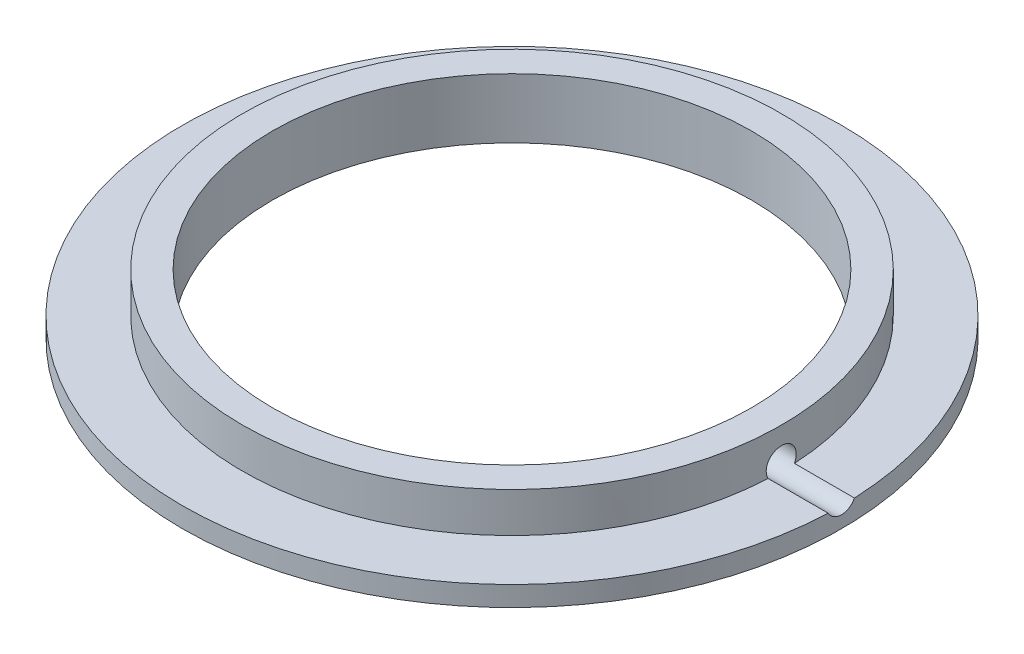
ISO-10303-21;
HEADER;
FILE_DESCRIPTION(('STEP AP214'),'2;1');
FILE_NAME('part.step','',(''),(''),'','','');
FILE_SCHEMA(('AUTOMOTIVE_DESIGN { 1 0 10303 214 1 1 1 1 }'));
ENDSEC;
DATA;
#1=APPLICATION_CONTEXT('core data for automotive mechanical design processes');
#2=APPLICATION_PROTOCOL_DEFINITION('international standard','automotive_design',2000,#1);
#3=PRODUCT_CONTEXT('',#1,'mechanical');
#4=PRODUCT('Part','Part','',(#3));
#5=PRODUCT_RELATED_PRODUCT_CATEGORY('part','',(#4));
#6=PRODUCT_DEFINITION_FORMATION('','',#4);
#7=PRODUCT_DEFINITION_CONTEXT('part definition',#1,'design');
#8=PRODUCT_DEFINITION('design','',#6,#7);
#9=PRODUCT_DEFINITION_SHAPE('','',#8);
#10=(LENGTH_UNIT() NAMED_UNIT(*) SI_UNIT(.MILLI.,.METRE.));
#11=(NAMED_UNIT(*) PLANE_ANGLE_UNIT() SI_UNIT($,.RADIAN.));
#12=(NAMED_UNIT(*) SI_UNIT($,.STERADIAN.) SOLID_ANGLE_UNIT());
#13=UNCERTAINTY_MEASURE_WITH_UNIT(LENGTH_MEASURE(1.E-05),#10,'distance_accuracy_value','');
#14=(GEOMETRIC_REPRESENTATION_CONTEXT(3) GLOBAL_UNCERTAINTY_ASSIGNED_CONTEXT((#13)) GLOBAL_UNIT_ASSIGNED_CONTEXT((#10,
#11,#12)) REPRESENTATION_CONTEXT('',''));
#15=CARTESIAN_POINT('',(0.,0.,0.));
#16=DIRECTION('',(0.,0.,1.));
#17=DIRECTION('',(1.,0.,0.));
#18=AXIS2_PLACEMENT_3D('',#15,#16,#17);
#19=CARTESIAN_POINT('',(0.,1.,0.));
#20=DIRECTION('',(0.,-1.,0.));
#21=DIRECTION('',(0.,0.,-1.));
#22=AXIS2_PLACEMENT_3D('',#19,#20,#21);
#23=CYLINDRICAL_SURFACE('',#22,16.5);
#24=CARTESIAN_POINT('',(0.,0.,0.));
#25=DIRECTION('',(0.,1.,0.));
#26=DIRECTION('',(0.,0.,1.));
#27=AXIS2_PLACEMENT_3D('',#24,#25,#26);
#28=CIRCLE('',#27,16.5);
#29=CARTESIAN_POINT('',(0.,0.,16.5));
#30=VERTEX_POINT('',#29);
#31=EDGE_CURVE('E46',#30,#30,#28,.T.);
#32=ORIENTED_EDGE('',*,*,#31,.T.);
#33=EDGE_LOOP('',(#32));
#34=FACE_BOUND('',#33,.T.);
#35=CARTESIAN_POINT('',(16.4868765992834,1.,0.657951365983839));
#36=CARTESIAN_POINT('',(16.4876833379462,0.962960108270043,0.637725419364401));
#37=CARTESIAN_POINT('',(16.4885807541448,0.927674301830206,0.614320157853908));
#38=CARTESIAN_POINT('',(16.4904484709403,0.861536434292758,0.561958452032811));
#39=CARTESIAN_POINT('',(16.4914187185096,0.830681194125467,0.533006023161448));
#40=CARTESIAN_POINT('',(16.4933255406306,0.77426102802423,0.47031155166238));
#41=CARTESIAN_POINT('',(16.4942620994731,0.748698544378894,0.436567309955041));
#42=CARTESIAN_POINT('',(16.4959948700238,0.703604763923448,0.365271263773181));
#43=CARTESIAN_POINT('',(16.4967911093437,0.684072279977721,0.327720210687867));
#44=CARTESIAN_POINT('',(16.4981537441256,0.651591820430562,0.249873173165701));
#45=CARTESIAN_POINT('',(16.4987201741902,0.638642853467569,0.209577603041595));
#46=CARTESIAN_POINT('',(16.4995595196029,0.619692769858873,0.127375286806824));
#47=CARTESIAN_POINT('',(16.4998323919312,0.613692671536965,0.0854683054809608));
#48=CARTESIAN_POINT('',(16.5000535863455,0.608817903203791,0.00128088901380076));
#49=CARTESIAN_POINT('',(16.5000022144909,0.609936513734719,-0.0409991563440351));
#50=CARTESIAN_POINT('',(16.499581447377,0.619251004206329,-0.12476616985426));
#51=CARTESIAN_POINT('',(16.4992120862815,0.627446123866405,-0.166253222714167));
#52=CARTESIAN_POINT('',(16.4981971716211,0.650673945532818,-0.247246796418182));
#53=CARTESIAN_POINT('',(16.4975517153555,0.665704238856917,-0.286754009508052));
#54=CARTESIAN_POINT('',(16.4960569300761,0.702182065236904,-0.362698493159102));
#55=CARTESIAN_POINT('',(16.4952075371901,0.723631609299232,-0.399134797082515));
#56=CARTESIAN_POINT('',(16.4933994233861,0.772362999446572,-0.467935447552244));
#57=CARTESIAN_POINT('',(16.4924405544464,0.799652786705083,-0.500294153503792));
#58=CARTESIAN_POINT('',(16.4905232657077,0.859261747579752,-0.559940559430578));
#59=CARTESIAN_POINT('',(16.4895648472062,0.891573720480946,-0.587235398846315));
#60=CARTESIAN_POINT('',(16.4883477564197,0.937798272830575,-0.620048222905477));
#61=CARTESIAN_POINT('',(16.4880410259913,0.949939009522424,-0.628142755962978));
#62=CARTESIAN_POINT('',(16.4874449823137,0.974650729375382,-0.643597201422278));
#63=CARTESIAN_POINT('',(16.4871556399936,0.98722093599651,-0.650958354321469));
#64=CARTESIAN_POINT('',(16.4868765992834,1.,-0.657951365983839));
#65=B_SPLINE_CURVE_WITH_KNOTS('',3,(#35,#36,#37,#38,#39,#40,#41,#42,#43,#44,#45,#46,#47,#48,#49,
#50,#51,#52,#53,#54,#55,#56,#57,#58,#59,#60,#61,#62,#63,#64),.UNSPECIFIED.,.F.,.F.,(4,2,2,2,2,2,
2,2,2,2,2,2,2,2,4),(0.,0.126461639768176,0.252832081007328,0.379260705279178,0.505664423450857,
0.632049101809983,0.758452298902637,0.884736199799209,1.01100653478992,1.1372324071632,
1.26349786472281,1.38993611303403,1.51619472100948,1.55996122521623,1.60365239550557),.UNSPECIFIED.);
#66=CARTESIAN_POINT('',(16.4868765992834,1.,0.657951365983839));
#67=VERTEX_POINT('',#66);
#68=CARTESIAN_POINT('',(16.4868765992834,1.,-0.657951365983839));
#69=VERTEX_POINT('',#68);
#70=EDGE_CURVE('E59',#67,#69,#65,.T.);
#71=ORIENTED_EDGE('',*,*,#70,.F.);
#72=CARTESIAN_POINT('',(0.,1.,0.));
#73=DIRECTION('',(0.,1.,0.));
#74=DIRECTION('',(0.,0.,1.));
#75=AXIS2_PLACEMENT_3D('',#72,#73,#74);
#76=CIRCLE('',#75,16.5);
#77=EDGE_CURVE('E11',#69,#67,#76,.T.);
#78=ORIENTED_EDGE('',*,*,#77,.F.);
#79=EDGE_LOOP('',(#71,#78));
#80=FACE_BOUND('',#79,.T.);
#81=ADVANCED_FACE('F33',(#34,#80),#23,.T.);
#82=CARTESIAN_POINT('',(0.,1.,0.));
#83=DIRECTION('',(0.,1.,0.));
#84=DIRECTION('',(0.,0.,1.));
#85=AXIS2_PLACEMENT_3D('',#82,#83,#84);
#86=PLANE('',#85);
#87=CARTESIAN_POINT('',(0.,1.,0.));
#88=DIRECTION('',(0.,1.,0.));
#89=DIRECTION('',(0.,0.,1.));
#90=AXIS2_PLACEMENT_3D('',#87,#88,#89);
#91=CIRCLE('',#90,13.5);
#92=CARTESIAN_POINT('',(13.4839571343134,1.,0.657951365983839));
#93=VERTEX_POINT('',#92);
#94=CARTESIAN_POINT('',(13.4839571343134,1.,-0.657951365983839));
#95=VERTEX_POINT('',#94);
#96=EDGE_CURVE('E73',#93,#95,#91,.F.);
#97=ORIENTED_EDGE('',*,*,#96,.T.);
#98=DIRECTION('',(-1.,0.,0.));
#99=VECTOR('',#98,1.);
#100=CARTESIAN_POINT('',(17.,1.,-0.657951365983839));
#101=LINE('',#100,#99);
#102=EDGE_CURVE('E54',#95,#69,#101,.F.);
#103=ORIENTED_EDGE('',*,*,#102,.T.);
#104=ORIENTED_EDGE('',*,*,#77,.T.);
#105=DIRECTION('',(-1.,0.,0.));
#106=VECTOR('',#105,1.);
#107=CARTESIAN_POINT('',(17.,1.,0.657951365983839));
#108=LINE('',#107,#106);
#109=EDGE_CURVE('E66',#67,#93,#108,.T.);
#110=ORIENTED_EDGE('',*,*,#109,.T.);
#111=EDGE_LOOP('',(#97,#103,#104,#110));
#112=FACE_BOUND('',#111,.T.);
#113=ADVANCED_FACE('F72',(#112),#86,.T.);
#114=CARTESIAN_POINT('',(0.,3.,0.));
#115=DIRECTION('',(0.,-1.,0.));
#116=DIRECTION('',(0.,0.,-1.));
#117=AXIS2_PLACEMENT_3D('',#114,#115,#116);
#118=CYLINDRICAL_SURFACE('',#117,13.5);
#119=CARTESIAN_POINT('',(0.,3.,0.));
#120=DIRECTION('',(0.,1.,0.));
#121=DIRECTION('',(0.,0.,1.));
#122=AXIS2_PLACEMENT_3D('',#119,#120,#121);
#123=CIRCLE('',#122,13.5);
#124=CARTESIAN_POINT('',(0.,3.,13.5));
#125=VERTEX_POINT('',#124);
#126=EDGE_CURVE('E77',#125,#125,#123,.T.);
#127=ORIENTED_EDGE('',*,*,#126,.F.);
#128=EDGE_LOOP('',(#127));
#129=FACE_BOUND('',#128,.T.);
#130=CARTESIAN_POINT('',(13.4839571343134,1.,-0.657951365983839));
#131=CARTESIAN_POINT('',(13.4829639899617,1.03695165013405,-0.678210459099172));
#132=CARTESIAN_POINT('',(13.4820891442535,1.07563542423775,-0.695289318259189));
#133=CARTESIAN_POINT('',(13.4806479930376,1.15528993468038,-0.722739601423298));
#134=CARTESIAN_POINT('',(13.4800814691034,1.19625902926828,-0.73311577483726));
#135=CARTESIAN_POINT('',(13.479327104592,1.2793833320724,-0.746846842489374));
#136=CARTESIAN_POINT('',(13.4791394532905,1.32153912247593,-0.750198227345299));
#137=CARTESIAN_POINT('',(13.4791626814607,1.40580588051924,-0.749783789688884));
#138=CARTESIAN_POINT('',(13.4793734763956,1.44791685577063,-0.746019476884902));
#139=CARTESIAN_POINT('',(13.4801698744889,1.53088362124593,-0.731485959105203));
#140=CARTESIAN_POINT('',(13.4807552626461,1.57174011740102,-0.720720772283952));
#141=CARTESIAN_POINT('',(13.4822345604551,1.65107217443385,-0.692495346791738));
#142=CARTESIAN_POINT('',(13.4831285203186,1.68954734661376,-0.675034018455289));
#143=CARTESIAN_POINT('',(13.4851250615877,1.76305163088999,-0.633896361394058));
#144=CARTESIAN_POINT('',(13.4862278068687,1.79807800298032,-0.610215144998022));
#145=CARTESIAN_POINT('',(13.4885172155161,1.86365923235761,-0.557316858666673));
#146=CARTESIAN_POINT('',(13.4897038742078,1.89421433844466,-0.528100096960212));
#147=CARTESIAN_POINT('',(13.4920292459961,1.95002859641628,-0.464914417661529));
#148=CARTESIAN_POINT('',(13.4931678959028,1.97528093255812,-0.43093947661524));
#149=CARTESIAN_POINT('',(13.4952673604024,2.01972400200207,-0.359226592542001));
#150=CARTESIAN_POINT('',(13.4962281716189,2.03891462022346,-0.321488578091611));
#151=CARTESIAN_POINT('',(13.497863379786,2.07068197044403,-0.243331141255163));
#152=CARTESIAN_POINT('',(13.4985378591261,2.08326060523141,-0.202912494073087));
#153=CARTESIAN_POINT('',(13.4995247203172,2.10145200937286,-0.12053295205401));
#154=CARTESIAN_POINT('',(13.4998371076048,2.10706488331144,-0.0785720803818349));
#155=CARTESIAN_POINT('',(13.5000643888956,2.11116100761349,0.0056393506149272));
#156=CARTESIAN_POINT('',(13.4999798281346,2.10965403755969,0.0478894330289493));
#157=CARTESIAN_POINT('',(13.4994239909716,2.09957616194939,0.131535796161776));
#158=CARTESIAN_POINT('',(13.4989527152801,2.0910052693697,0.172932078448914));
#159=CARTESIAN_POINT('',(13.4976766970463,2.06704884201685,0.253682938747273));
#160=CARTESIAN_POINT('',(13.4968720635106,2.05166553476055,0.293038179441279));
#161=CARTESIAN_POINT('',(13.4950197388363,2.01452281351665,0.368608955339374));
#162=CARTESIAN_POINT('',(13.4939720452514,1.99276333535533,0.404824458938458));
#163=CARTESIAN_POINT('',(13.4917498404175,1.94345444391993,0.473135856813811));
#164=CARTESIAN_POINT('',(13.4905751749997,1.91589795265358,0.505226637036262));
#165=CARTESIAN_POINT('',(13.4882322301666,1.8557906913474,0.564329811254234));
#166=CARTESIAN_POINT('',(13.487063950815,1.82323987154117,0.591342154639293));
#167=CARTESIAN_POINT('',(13.4848643449244,1.7540325401326,0.639545335582111));
#168=CARTESIAN_POINT('',(13.4838331423898,1.71737236557801,0.660730920323212));
#169=CARTESIAN_POINT('',(13.4820255231305,1.6410111910472,0.696643911712528));
#170=CARTESIAN_POINT('',(13.4812490906074,1.60131037981035,0.71137171882894));
#171=CARTESIAN_POINT('',(13.4800394100473,1.52003438347111,0.733938760799265));
#172=CARTESIAN_POINT('',(13.4796058228707,1.47846109375472,0.74178480387323));
#173=CARTESIAN_POINT('',(13.4791296561988,1.39457037284459,0.750388567475981));
#174=CARTESIAN_POINT('',(13.4790872062299,1.35225269979348,0.751143939907066));
#175=CARTESIAN_POINT('',(13.4793980138819,1.26812119616291,0.74554394958996));
#176=CARTESIAN_POINT('',(13.4797510288503,1.22630707251576,0.739192947230847));
#177=CARTESIAN_POINT('',(13.4808128901258,1.14439816264248,0.719571318692191));
#178=CARTESIAN_POINT('',(13.4815211638896,1.10430072226411,0.706311825070558));
#179=CARTESIAN_POINT('',(13.4828530003412,1.04323328858363,0.680262415887484));
#180=CARTESIAN_POINT('',(13.483386507755,1.0213228012121,0.669628769018965));
#181=CARTESIAN_POINT('',(13.4839571343134,1.,0.657951365983839));
#182=B_SPLINE_CURVE_WITH_KNOTS('',3,(#130,#131,#132,#133,#134,#135,#136,#137,#138,#139,#140,
#141,#142,#143,#144,#145,#146,#147,#148,#149,#150,#151,#152,#153,#154,#155,#156,#157,#158,#159,
#160,#161,#162,#163,#164,#165,#166,#167,#168,#169,#170,#171,#172,#173,#174,#175,#176,#177,#178,
#179,#180,#181),.UNSPECIFIED.,.F.,.F.,(4,2,2,2,2,2,2,2,2,2,2,2,2,2,2,2,2,2,2,2,2,2,2,2,2,4),(0.,
0.126291459167034,0.252493331891881,0.378758236429278,0.504996354867043,0.631162082755062,
0.757348350355026,0.883634075033569,1.00991276996742,1.13635279286853,1.26279521606859,
1.38920123187967,1.51560534979734,1.64183589370761,1.76806620572618,1.89425527351845,
2.02044561139894,2.14679092784055,2.27313750334197,2.39959760956147,2.52604987246109,
2.6523768929014,2.77874574545339,2.9050371020434,3.03112557536673,3.10408560676136),.UNSPECIFIED.);
#183=EDGE_CURVE('E63',#95,#93,#182,.T.);
#184=ORIENTED_EDGE('',*,*,#183,.F.);
#185=ORIENTED_EDGE('',*,*,#96,.F.);
#186=EDGE_LOOP('',(#184,#185));
#187=FACE_BOUND('',#186,.T.);
#188=ADVANCED_FACE('F76',(#129,#187),#118,.T.);
#189=CARTESIAN_POINT('',(0.,3.,0.));
#190=DIRECTION('',(0.,-1.,0.));
#191=DIRECTION('',(0.,0.,-1.));
#192=AXIS2_PLACEMENT_3D('',#189,#190,#191);
#193=CYLINDRICAL_SURFACE('',#192,12.);
#194=CARTESIAN_POINT('',(0.,0.,0.));
#195=DIRECTION('',(0.,1.,0.));
#196=DIRECTION('',(0.,0.,1.));
#197=AXIS2_PLACEMENT_3D('',#194,#195,#196);
#198=CIRCLE('',#197,12.);
#199=CARTESIAN_POINT('',(0.,0.,12.));
#200=VERTEX_POINT('',#199);
#201=EDGE_CURVE('E84',#200,#200,#198,.T.);
#202=ORIENTED_EDGE('',*,*,#201,.F.);
#203=EDGE_LOOP('',(#202));
#204=FACE_BOUND('',#203,.T.);
#205=CARTESIAN_POINT('',(0.,3.,0.));
#206=DIRECTION('',(0.,1.,0.));
#207=DIRECTION('',(0.,0.,1.));
#208=AXIS2_PLACEMENT_3D('',#205,#206,#207);
#209=CIRCLE('',#208,12.);
#210=CARTESIAN_POINT('',(0.,3.,12.));
#211=VERTEX_POINT('',#210);
#212=EDGE_CURVE('E81',#211,#211,#209,.T.);
#213=ORIENTED_EDGE('',*,*,#212,.T.);
#214=EDGE_LOOP('',(#213));
#215=FACE_BOUND('',#214,.T.);
#216=CARTESIAN_POINT('',(11.9765395670035,1.36,0.75));
#217=CARTESIAN_POINT('',(11.9765398808515,1.31791633546045,0.749998148234391));
#218=CARTESIAN_POINT('',(11.976763765356,1.27580320385201,0.746446027381309));
#219=CARTESIAN_POINT('',(11.9776352175463,1.19273978918823,0.732326903274635));
#220=CARTESIAN_POINT('',(11.9782832783692,1.15179091756207,0.721751734984414));
#221=CARTESIAN_POINT('',(11.9799293918754,1.07227123066678,0.693891457516701));
#222=CARTESIAN_POINT('',(11.9809272597877,1.03369917256705,0.676609890200353));
#223=CARTESIAN_POINT('',(11.9831603169988,0.960013427924135,0.63583310409042));
#224=CARTESIAN_POINT('',(11.9843954519378,0.924898952002772,0.612339308105547));
#225=CARTESIAN_POINT('',(11.986965973198,0.859062276588638,0.559766242288687));
#226=CARTESIAN_POINT('',(11.9883014902415,0.828345961170733,0.530679609673741));
#227=CARTESIAN_POINT('',(11.9909210768263,0.772227882492568,0.467761715850859));
#228=CARTESIAN_POINT('',(11.9922051442199,0.746826340904176,0.433930256841035));
#229=CARTESIAN_POINT('',(11.9945782673973,0.702040920464877,0.362450030370215));
#230=CARTESIAN_POINT('',(11.9956671658679,0.682661886825117,0.32479822150683));
#231=CARTESIAN_POINT('',(11.9975258836563,0.650502610545056,0.246767425332054));
#232=CARTESIAN_POINT('',(11.9982957063896,0.637722297273135,0.206388467216853));
#233=CARTESIAN_POINT('',(11.9994286309673,0.619139510503017,0.12410606157313));
#234=CARTESIAN_POINT('',(11.9997922679737,0.613327854845027,0.0822046952424022));
#235=CARTESIAN_POINT('',(12.0000736492771,0.608818999481503,-0.00198029747683373));
#236=CARTESIAN_POINT('',(11.9999913986001,0.610121719585129,-0.0442639195513206));
#237=CARTESIAN_POINT('',(11.9993907192821,0.619797060605444,-0.127950951303184));
#238=CARTESIAN_POINT('',(11.9988729000507,0.62815980381239,-0.169355507956291));
#239=CARTESIAN_POINT('',(11.9974600834586,0.65170247526242,-0.250172017682656));
#240=CARTESIAN_POINT('',(11.9965650838681,0.666882443804572,-0.289583958975317));
#241=CARTESIAN_POINT('',(11.9944976289414,0.703639846935117,-0.365328182538403));
#242=CARTESIAN_POINT('',(11.9933249795835,0.725221757878447,-0.40165828699869));
#243=CARTESIAN_POINT('',(11.9908341972955,0.774167157060591,-0.470183773828426));
#244=CARTESIAN_POINT('',(11.9895160627284,0.80153071036044,-0.502379109662614));
#245=CARTESIAN_POINT('',(11.9868799955488,0.861318430663149,-0.561778804586851));
#246=CARTESIAN_POINT('',(11.9855620671361,0.893751171225205,-0.588974535042819));
#247=CARTESIAN_POINT('',(11.9830772491407,0.962726581217197,-0.637536503624623));
#248=CARTESIAN_POINT('',(11.9819103596183,0.999269252282665,-0.65890273943062));
#249=CARTESIAN_POINT('',(11.9798593909216,1.07543269433556,-0.695198594408244));
#250=CARTESIAN_POINT('',(11.9789753277171,1.11505363897985,-0.710127850134251));
#251=CARTESIAN_POINT('',(11.9775902785025,1.1962464191762,-0.733120000215052));
#252=CARTESIAN_POINT('',(11.977089287986,1.23781823177228,-0.741182975344416));
#253=CARTESIAN_POINT('',(11.976527726221,1.32165740940924,-0.750202935568542));
#254=CARTESIAN_POINT('',(11.976466411591,1.36392347927302,-0.751171914887118));
#255=CARTESIAN_POINT('',(11.9767891741635,1.44801755373797,-0.746007715768143));
#256=CARTESIAN_POINT('',(11.9771732490486,1.4898455606174,-0.739874574285647));
#257=CARTESIAN_POINT('',(11.9783428288387,1.57184224621941,-0.720690194471224));
#258=CARTESIAN_POINT('',(11.9791280131916,1.61201222231638,-0.707644480106592));
#259=CARTESIAN_POINT('',(11.981011055363,1.68959261107715,-0.675010870215402));
#260=CARTESIAN_POINT('',(11.9821089160172,1.72700299871101,-0.655422915358457));
#261=CARTESIAN_POINT('',(11.9844953944499,1.79805736050272,-0.610230205054659));
#262=CARTESIAN_POINT('',(11.9857842661676,1.83169621440063,-0.584617412870816));
#263=CARTESIAN_POINT('',(11.9884066335813,1.89420104489597,-0.528113778271147));
#264=CARTESIAN_POINT('',(11.9897401297142,1.92306697475107,-0.497222884171702));
#265=CARTESIAN_POINT('',(11.9923036527898,1.97524707208927,-0.430988304268219));
#266=CARTESIAN_POINT('',(11.993533533545,1.99855347794692,-0.395638497371853));
#267=CARTESIAN_POINT('',(11.995749140607,2.03889983042688,-0.321520327614131));
#268=CARTESIAN_POINT('',(11.9967348684196,2.0559398157001,-0.282751985839922));
#269=CARTESIAN_POINT('',(11.9983504016545,2.08325612437422,-0.202925772187232));
#270=CARTESIAN_POINT('',(11.9989804655315,2.09353736013731,-0.161869586744598));
#271=CARTESIAN_POINT('',(11.999814706859,2.10706039964346,-0.0786096716811567));
#272=CARTESIAN_POINT('',(12.0000188884995,2.11030227264423,-0.0364059533546404));
#273=CARTESIAN_POINT('',(11.9999783715917,2.10965388825786,0.0478741897198851));
#274=CARTESIAN_POINT('',(11.9997344375557,2.10577577799882,0.089950708824876));
#275=CARTESIAN_POINT('',(11.9988266388255,2.09102269732559,0.172853901636081));
#276=CARTESIAN_POINT('',(11.9981627733929,2.08014771461049,0.213680573144858));
#277=CARTESIAN_POINT('',(11.9964897304098,2.05171232741377,0.292926988716244));
#278=CARTESIAN_POINT('',(11.9954805553142,2.03415197046346,0.331346749889108));
#279=CARTESIAN_POINT('',(11.9932302001794,1.99284600578472,0.404694206908858));
#280=CARTESIAN_POINT('',(11.9919890261583,1.96910055849485,0.439621993303545));
#281=CARTESIAN_POINT('',(11.989411771617,1.9160536025718,0.505055616085724));
#282=CARTESIAN_POINT('',(11.988075543323,1.88674331921193,0.535554332758941));
#283=CARTESIAN_POINT('',(11.9854599553314,1.8234103577067,0.591209039052709));
#284=CARTESIAN_POINT('',(11.9841806096315,1.78938652802865,0.616363719293894));
#285=CARTESIAN_POINT('',(11.9818218611989,1.71755338811019,0.660634938886919));
#286=CARTESIAN_POINT('',(11.9807427086114,1.67973943165508,0.679743944792959));
#287=CARTESIAN_POINT('',(11.978909740856,1.60146061928746,0.711318422526847));
#288=CARTESIAN_POINT('',(11.9781555448386,1.56099893096664,0.723791675516788));
#289=CARTESIAN_POINT('',(11.9772555405839,1.49357475141278,0.738498665295461));
#290=CARTESIAN_POINT('',(11.9769882502826,1.46704809060072,0.742806088494284));
#291=CARTESIAN_POINT('',(11.9766301635011,1.41368495076637,0.748557344547071));
#292=CARTESIAN_POINT('',(11.9765393667752,1.38684847217534,0.750001181386601));
#293=CARTESIAN_POINT('',(11.9765395670035,1.36,0.75));
#294=B_SPLINE_CURVE_WITH_KNOTS('',3,(#216,#217,#218,#219,#220,#221,#222,#223,#224,#225,#226,
#227,#228,#229,#230,#231,#232,#233,#234,#235,#236,#237,#238,#239,#240,#241,#242,#243,#244,#245,
#246,#247,#248,#249,#250,#251,#252,#253,#254,#255,#256,#257,#258,#259,#260,#261,#262,#263,#264,
#265,#266,#267,#268,#269,#270,#271,#272,#273,#274,#275,#276,#277,#278,#279,#280,#281,#282,#283,
#284,#285,#286,#287,#288,#289,#290,#291,#292,#293),.UNSPECIFIED.,.T.,.F.,(4,2,2,2,2,2,2,2,2,2,2,
2,2,2,2,2,2,2,2,2,2,2,2,2,2,2,2,2,2,2,2,2,2,2,2,2,2,2,4),(0.,0.126152979926868,
0.252452883417183,0.378686174518845,0.504890578968163,0.631262279118843,0.757639249008161,
0.884117629699986,1.01059465655992,1.13690484885942,1.26321361743605,1.38934595916369,
1.51547904651469,1.64170053715023,1.76792344823653,1.89436219855752,2.02080099919451,
2.14724693790116,2.27369138908376,2.39992200393315,2.52615196195925,2.6522811990395,
2.77841157999389,2.90471117436913,3.03101200555153,3.15748814605052,3.28396350643913,
3.41034684067534,3.53672893146674,3.66289560699201,3.78906250432625,3.9152285046628,
4.04139123263361,4.16775457361486,4.29414884013622,4.42069999038267,4.54710241633272,
4.62758541425004,4.70806830015033),.UNSPECIFIED.);
#295=CARTESIAN_POINT('',(11.9765395670035,1.36,0.75));
#296=VERTEX_POINT('',#295);
#297=EDGE_CURVE('E37',#296,#296,#294,.T.);
#298=ORIENTED_EDGE('',*,*,#297,.T.);
#299=EDGE_LOOP('',(#298));
#300=FACE_BOUND('',#299,.T.);
#301=ADVANCED_FACE('F97',(#204,#215,#300),#193,.F.);
#302=CARTESIAN_POINT('',(0.,0.,0.));
#303=DIRECTION('',(0.,1.,0.));
#304=DIRECTION('',(0.,0.,1.));
#305=AXIS2_PLACEMENT_3D('',#302,#303,#304);
#306=PLANE('',#305);
#307=ORIENTED_EDGE('',*,*,#201,.T.);
#308=EDGE_LOOP('',(#307));
#309=FACE_BOUND('',#308,.T.);
#310=ORIENTED_EDGE('',*,*,#31,.F.);
#311=EDGE_LOOP('',(#310));
#312=FACE_BOUND('',#311,.T.);
#313=ADVANCED_FACE('F111',(#309,#312),#306,.F.);
#314=CARTESIAN_POINT('',(0.,3.,0.));
#315=DIRECTION('',(0.,1.,0.));
#316=DIRECTION('',(0.,0.,1.));
#317=AXIS2_PLACEMENT_3D('',#314,#315,#316);
#318=PLANE('',#317);
#319=ORIENTED_EDGE('',*,*,#212,.F.);
#320=EDGE_LOOP('',(#319));
#321=FACE_BOUND('',#320,.T.);
#322=ORIENTED_EDGE('',*,*,#126,.T.);
#323=EDGE_LOOP('',(#322));
#324=FACE_BOUND('',#323,.T.);
#325=ADVANCED_FACE('F95',(#321,#324),#318,.T.);
#326=CARTESIAN_POINT('',(17.,1.36,0.));
#327=DIRECTION('',(-1.,0.,0.));
#328=DIRECTION('',(0.,0.,1.));
#329=AXIS2_PLACEMENT_3D('',#326,#327,#328);
#330=CYLINDRICAL_SURFACE('',#329,0.75);
#331=ORIENTED_EDGE('',*,*,#297,.F.);
#332=EDGE_LOOP('',(#331));
#333=FACE_BOUND('',#332,.T.);
#334=ORIENTED_EDGE('',*,*,#70,.T.);
#335=ORIENTED_EDGE('',*,*,#102,.F.);
#336=ORIENTED_EDGE('',*,*,#183,.T.);
#337=ORIENTED_EDGE('',*,*,#109,.F.);
#338=EDGE_LOOP('',(#334,#335,#336,#337));
#339=FACE_BOUND('',#338,.T.);
#340=ADVANCED_FACE('F65',(#333,#339),#330,.F.);
#341=CLOSED_SHELL('',(#81,#113,#188,#301,#313,#325,#340));
#342=MANIFOLD_SOLID_BREP('B2',#341);
#343=ADVANCED_BREP_SHAPE_REPRESENTATION('',(#18,#342),#14);
#344=SHAPE_DEFINITION_REPRESENTATION(#9,#343);
ENDSEC;
END-ISO-10303-21;
